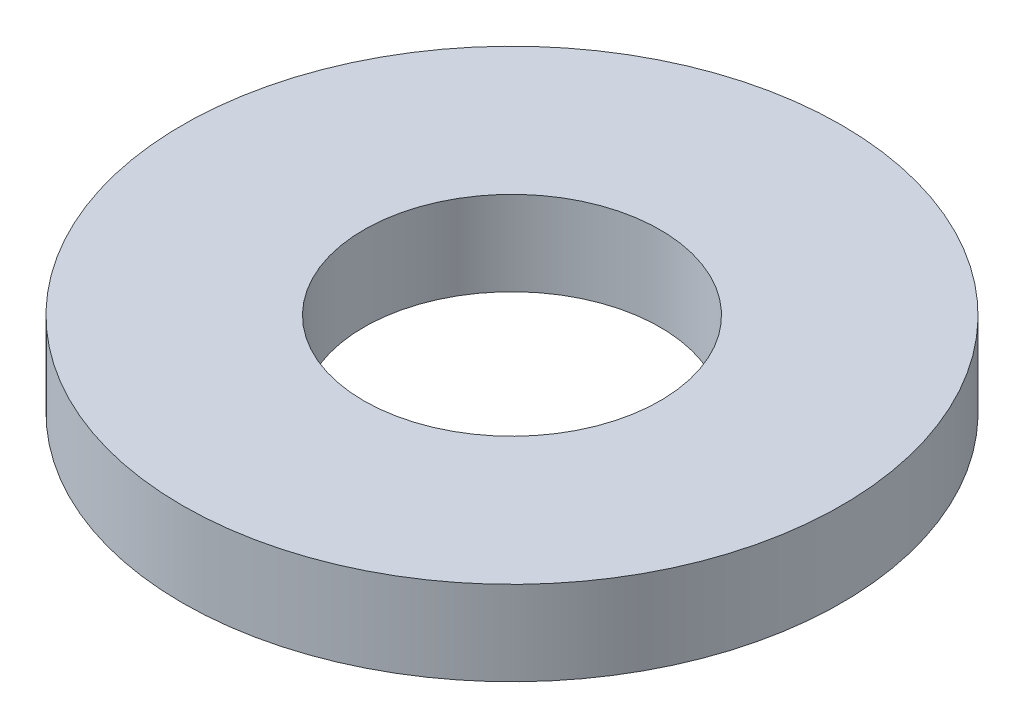
ISO-10303-21;
HEADER;
FILE_DESCRIPTION(('STEP AP214'),'2;1');
FILE_NAME('part.step','',(''),(''),'','','');
FILE_SCHEMA(('AUTOMOTIVE_DESIGN { 1 0 10303 214 1 1 1 1 }'));
ENDSEC;
DATA;
#1=APPLICATION_CONTEXT('core data for automotive mechanical design processes');
#2=APPLICATION_PROTOCOL_DEFINITION('international standard','automotive_design',2000,#1);
#3=PRODUCT_CONTEXT('',#1,'mechanical');
#4=PRODUCT('Part','Part','',(#3));
#5=PRODUCT_RELATED_PRODUCT_CATEGORY('part','',(#4));
#6=PRODUCT_DEFINITION_FORMATION('','',#4);
#7=PRODUCT_DEFINITION_CONTEXT('part definition',#1,'design');
#8=PRODUCT_DEFINITION('design','',#6,#7);
#9=PRODUCT_DEFINITION_SHAPE('','',#8);
#10=(LENGTH_UNIT() NAMED_UNIT(*) SI_UNIT(.MILLI.,.METRE.));
#11=(NAMED_UNIT(*) PLANE_ANGLE_UNIT() SI_UNIT($,.RADIAN.));
#12=(NAMED_UNIT(*) SI_UNIT($,.STERADIAN.) SOLID_ANGLE_UNIT());
#13=UNCERTAINTY_MEASURE_WITH_UNIT(LENGTH_MEASURE(1.E-05),#10,'distance_accuracy_value','');
#14=(GEOMETRIC_REPRESENTATION_CONTEXT(3) GLOBAL_UNCERTAINTY_ASSIGNED_CONTEXT((#13)) GLOBAL_UNIT_ASSIGNED_CONTEXT((#10,
#11,#12)) REPRESENTATION_CONTEXT('',''));
#15=CARTESIAN_POINT('',(0.,0.,0.));
#16=DIRECTION('',(0.,0.,1.));
#17=DIRECTION('',(1.,0.,0.));
#18=AXIS2_PLACEMENT_3D('',#15,#16,#17);
#19=CARTESIAN_POINT('',(0.,2.032,0.));
#20=DIRECTION('',(0.,-1.,0.));
#21=DIRECTION('',(0.,0.,-1.));
#22=AXIS2_PLACEMENT_3D('',#19,#20,#21);
#23=CYLINDRICAL_SURFACE('',#22,7.9375);
#24=CARTESIAN_POINT('',(0.,2.032,0.));
#25=DIRECTION('',(0.,1.,0.));
#26=DIRECTION('',(0.,0.,1.));
#27=AXIS2_PLACEMENT_3D('',#24,#25,#26);
#28=CIRCLE('',#27,7.9375);
#29=CARTESIAN_POINT('',(0.,2.032,7.9375));
#30=VERTEX_POINT('',#29);
#31=EDGE_CURVE('E10',#30,#30,#28,.T.);
#32=ORIENTED_EDGE('',*,*,#31,.F.);
#33=EDGE_LOOP('',(#32));
#34=FACE_BOUND('',#33,.T.);
#35=CARTESIAN_POINT('',(0.,0.,0.));
#36=DIRECTION('',(0.,1.,0.));
#37=DIRECTION('',(0.,0.,1.));
#38=AXIS2_PLACEMENT_3D('',#35,#36,#37);
#39=CIRCLE('',#38,7.9375);
#40=CARTESIAN_POINT('',(0.,0.,7.9375));
#41=VERTEX_POINT('',#40);
#42=EDGE_CURVE('E34',#41,#41,#39,.T.);
#43=ORIENTED_EDGE('',*,*,#42,.T.);
#44=EDGE_LOOP('',(#43));
#45=FACE_BOUND('',#44,.T.);
#46=ADVANCED_FACE('F31',(#34,#45),#23,.T.);
#47=CARTESIAN_POINT('',(0.,2.032,0.));
#48=DIRECTION('',(0.,1.,0.));
#49=DIRECTION('',(0.,0.,1.));
#50=AXIS2_PLACEMENT_3D('',#47,#48,#49);
#51=PLANE('',#50);
#52=CARTESIAN_POINT('',(0.,2.032,0.));
#53=DIRECTION('',(0.,1.,0.));
#54=DIRECTION('',(0.,0.,1.));
#55=AXIS2_PLACEMENT_3D('',#52,#53,#54);
#56=CIRCLE('',#55,3.5687);
#57=CARTESIAN_POINT('',(0.,2.032,3.5687));
#58=VERTEX_POINT('',#57);
#59=EDGE_CURVE('E43',#58,#58,#56,.T.);
#60=ORIENTED_EDGE('',*,*,#59,.F.);
#61=EDGE_LOOP('',(#60));
#62=FACE_BOUND('',#61,.T.);
#63=ORIENTED_EDGE('',*,*,#31,.T.);
#64=EDGE_LOOP('',(#63));
#65=FACE_BOUND('',#64,.T.);
#66=ADVANCED_FACE('F58',(#62,#65),#51,.T.);
#67=CARTESIAN_POINT('',(0.,0.,0.));
#68=DIRECTION('',(0.,1.,0.));
#69=DIRECTION('',(0.,0.,1.));
#70=AXIS2_PLACEMENT_3D('',#67,#68,#69);
#71=PLANE('',#70);
#72=CARTESIAN_POINT('',(0.,0.,0.));
#73=DIRECTION('',(0.,1.,0.));
#74=DIRECTION('',(0.,0.,1.));
#75=AXIS2_PLACEMENT_3D('',#72,#73,#74);
#76=CIRCLE('',#75,3.5687);
#77=CARTESIAN_POINT('',(0.,0.,3.5687));
#78=VERTEX_POINT('',#77);
#79=EDGE_CURVE('E41',#78,#78,#76,.T.);
#80=ORIENTED_EDGE('',*,*,#79,.T.);
#81=EDGE_LOOP('',(#80));
#82=FACE_BOUND('',#81,.T.);
#83=ORIENTED_EDGE('',*,*,#42,.F.);
#84=EDGE_LOOP('',(#83));
#85=FACE_BOUND('',#84,.T.);
#86=ADVANCED_FACE('F49',(#82,#85),#71,.F.);
#87=CARTESIAN_POINT('',(0.,0.,0.));
#88=DIRECTION('',(0.,1.,0.));
#89=DIRECTION('',(0.,0.,1.));
#90=AXIS2_PLACEMENT_3D('',#87,#88,#89);
#91=CYLINDRICAL_SURFACE('',#90,3.5687);
#92=ORIENTED_EDGE('',*,*,#79,.F.);
#93=EDGE_LOOP('',(#92));
#94=FACE_BOUND('',#93,.T.);
#95=ORIENTED_EDGE('',*,*,#59,.T.);
#96=EDGE_LOOP('',(#95));
#97=FACE_BOUND('',#96,.T.);
#98=ADVANCED_FACE('F52',(#94,#97),#91,.F.);
#99=CLOSED_SHELL('',(#46,#66,#86,#98));
#100=MANIFOLD_SOLID_BREP('B2',#99);
#101=ADVANCED_BREP_SHAPE_REPRESENTATION('',(#18,#100),#14);
#102=SHAPE_DEFINITION_REPRESENTATION(#9,#101);
ENDSEC;
END-ISO-10303-21;
